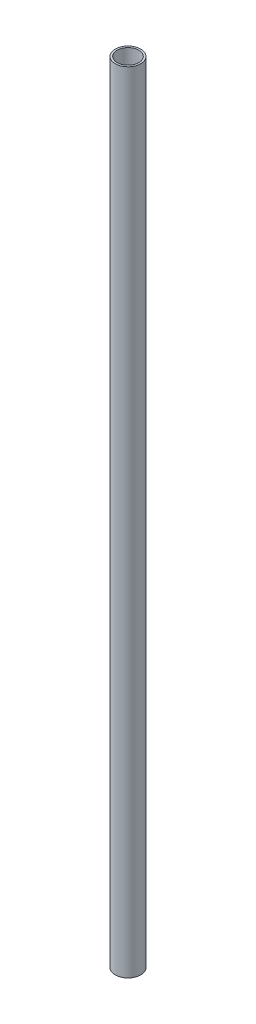
ISO-10303-21;
HEADER;
FILE_DESCRIPTION(('STEP AP214'),'2;1');
FILE_NAME('part.step','',(''),(''),'','','');
FILE_SCHEMA(('AUTOMOTIVE_DESIGN { 1 0 10303 214 1 1 1 1 }'));
ENDSEC;
DATA;
#1=APPLICATION_CONTEXT('core data for automotive mechanical design processes');
#2=APPLICATION_PROTOCOL_DEFINITION('international standard','automotive_design',2000,#1);
#3=PRODUCT_CONTEXT('',#1,'mechanical');
#4=PRODUCT('Part','Part','',(#3));
#5=PRODUCT_RELATED_PRODUCT_CATEGORY('part','',(#4));
#6=PRODUCT_DEFINITION_FORMATION('','',#4);
#7=PRODUCT_DEFINITION_CONTEXT('part definition',#1,'design');
#8=PRODUCT_DEFINITION('design','',#6,#7);
#9=PRODUCT_DEFINITION_SHAPE('','',#8);
#10=(LENGTH_UNIT() NAMED_UNIT(*) SI_UNIT(.MILLI.,.METRE.));
#11=(NAMED_UNIT(*) PLANE_ANGLE_UNIT() SI_UNIT($,.RADIAN.));
#12=(NAMED_UNIT(*) SI_UNIT($,.STERADIAN.) SOLID_ANGLE_UNIT());
#13=UNCERTAINTY_MEASURE_WITH_UNIT(LENGTH_MEASURE(1.E-05),#10,'distance_accuracy_value','');
#14=(GEOMETRIC_REPRESENTATION_CONTEXT(3) GLOBAL_UNCERTAINTY_ASSIGNED_CONTEXT((#13)) GLOBAL_UNIT_ASSIGNED_CONTEXT((#10,
#11,#12)) REPRESENTATION_CONTEXT('',''));
#15=CARTESIAN_POINT('',(0.,0.,0.));
#16=DIRECTION('',(0.,0.,1.));
#17=DIRECTION('',(1.,0.,0.));
#18=AXIS2_PLACEMENT_3D('',#15,#16,#17);
#19=CARTESIAN_POINT('',(0.,1240.,0.));
#20=DIRECTION('',(0.,-1.,0.));
#21=DIRECTION('',(0.,0.,-1.));
#22=AXIS2_PLACEMENT_3D('',#19,#20,#21);
#23=CYLINDRICAL_SURFACE('',#22,20.);
#24=CARTESIAN_POINT('',(0.,1240.,0.));
#25=DIRECTION('',(0.,1.,0.));
#26=DIRECTION('',(0.,0.,1.));
#27=AXIS2_PLACEMENT_3D('',#24,#25,#26);
#28=CIRCLE('',#27,20.);
#29=CARTESIAN_POINT('',(0.,1240.,20.));
#30=VERTEX_POINT('',#29);
#31=EDGE_CURVE('E10',#30,#30,#28,.T.);
#32=ORIENTED_EDGE('',*,*,#31,.F.);
#33=EDGE_LOOP('',(#32));
#34=FACE_BOUND('',#33,.T.);
#35=CARTESIAN_POINT('',(0.,0.,0.));
#36=DIRECTION('',(0.,1.,0.));
#37=DIRECTION('',(0.,0.,1.));
#38=AXIS2_PLACEMENT_3D('',#35,#36,#37);
#39=CIRCLE('',#38,20.);
#40=CARTESIAN_POINT('',(0.,0.,20.));
#41=VERTEX_POINT('',#40);
#42=EDGE_CURVE('E34',#41,#41,#39,.T.);
#43=ORIENTED_EDGE('',*,*,#42,.T.);
#44=EDGE_LOOP('',(#43));
#45=FACE_BOUND('',#44,.T.);
#46=ADVANCED_FACE('F31',(#34,#45),#23,.T.);
#47=CARTESIAN_POINT('',(0.,1240.,0.));
#48=DIRECTION('',(0.,1.,0.));
#49=DIRECTION('',(0.,0.,1.));
#50=AXIS2_PLACEMENT_3D('',#47,#48,#49);
#51=PLANE('',#50);
#52=CARTESIAN_POINT('',(0.,1240.,0.));
#53=DIRECTION('',(0.,1.,0.));
#54=DIRECTION('',(0.,0.,1.));
#55=AXIS2_PLACEMENT_3D('',#52,#53,#54);
#56=CIRCLE('',#55,17.);
#57=CARTESIAN_POINT('',(0.,1240.,17.));
#58=VERTEX_POINT('',#57);
#59=EDGE_CURVE('E45',#58,#58,#56,.T.);
#60=ORIENTED_EDGE('',*,*,#59,.F.);
#61=EDGE_LOOP('',(#60));
#62=FACE_BOUND('',#61,.T.);
#63=ORIENTED_EDGE('',*,*,#31,.T.);
#64=EDGE_LOOP('',(#63));
#65=FACE_BOUND('',#64,.T.);
#66=ADVANCED_FACE('F52',(#62,#65),#51,.T.);
#67=CARTESIAN_POINT('',(0.,0.,0.));
#68=DIRECTION('',(0.,1.,0.));
#69=DIRECTION('',(0.,0.,1.));
#70=AXIS2_PLACEMENT_3D('',#67,#68,#69);
#71=PLANE('',#70);
#72=CARTESIAN_POINT('',(0.,0.,0.));
#73=DIRECTION('',(0.,1.,0.));
#74=DIRECTION('',(0.,0.,1.));
#75=AXIS2_PLACEMENT_3D('',#72,#73,#74);
#76=CIRCLE('',#75,17.);
#77=CARTESIAN_POINT('',(0.,0.,17.));
#78=VERTEX_POINT('',#77);
#79=EDGE_CURVE('E41',#78,#78,#76,.F.);
#80=ORIENTED_EDGE('',*,*,#79,.F.);
#81=EDGE_LOOP('',(#80));
#82=FACE_BOUND('',#81,.T.);
#83=ORIENTED_EDGE('',*,*,#42,.F.);
#84=EDGE_LOOP('',(#83));
#85=FACE_BOUND('',#84,.T.);
#86=ADVANCED_FACE('F54',(#82,#85),#71,.F.);
#87=CARTESIAN_POINT('',(0.,-0.000999999999917733,0.));
#88=DIRECTION('',(0.,1.,0.));
#89=DIRECTION('',(0.,0.,1.));
#90=AXIS2_PLACEMENT_3D('',#87,#88,#89);
#91=CYLINDRICAL_SURFACE('',#90,17.);
#92=ORIENTED_EDGE('',*,*,#59,.T.);
#93=EDGE_LOOP('',(#92));
#94=FACE_BOUND('',#93,.T.);
#95=ORIENTED_EDGE('',*,*,#79,.T.);
#96=EDGE_LOOP('',(#95));
#97=FACE_BOUND('',#96,.T.);
#98=ADVANCED_FACE('F49',(#94,#97),#91,.F.);
#99=CLOSED_SHELL('',(#46,#66,#86,#98));
#100=MANIFOLD_SOLID_BREP('B2',#99);
#101=ADVANCED_BREP_SHAPE_REPRESENTATION('',(#18,#100),#14);
#102=SHAPE_DEFINITION_REPRESENTATION(#9,#101);
ENDSEC;
END-ISO-10303-21;
